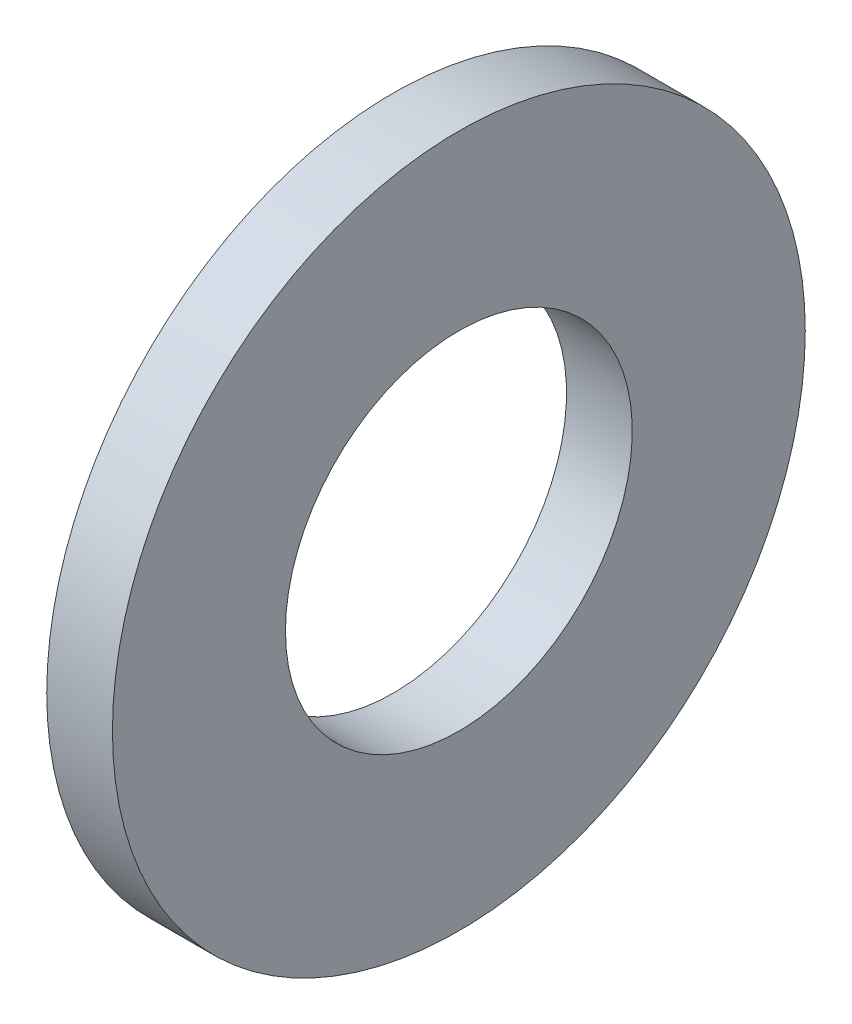
ISO-10303-21;
HEADER;
FILE_DESCRIPTION(('STEP AP214'),'2;1');
FILE_NAME('part.step','',(''),(''),'','','');
FILE_SCHEMA(('AUTOMOTIVE_DESIGN { 1 0 10303 214 1 1 1 1 }'));
ENDSEC;
DATA;
#1=APPLICATION_CONTEXT('core data for automotive mechanical design processes');
#2=APPLICATION_PROTOCOL_DEFINITION('international standard','automotive_design',2000,#1);
#3=PRODUCT_CONTEXT('',#1,'mechanical');
#4=PRODUCT('Part','Part','',(#3));
#5=PRODUCT_RELATED_PRODUCT_CATEGORY('part','',(#4));
#6=PRODUCT_DEFINITION_FORMATION('','',#4);
#7=PRODUCT_DEFINITION_CONTEXT('part definition',#1,'design');
#8=PRODUCT_DEFINITION('design','',#6,#7);
#9=PRODUCT_DEFINITION_SHAPE('','',#8);
#10=(LENGTH_UNIT() NAMED_UNIT(*) SI_UNIT(.MILLI.,.METRE.));
#11=(NAMED_UNIT(*) PLANE_ANGLE_UNIT() SI_UNIT($,.RADIAN.));
#12=(NAMED_UNIT(*) SI_UNIT($,.STERADIAN.) SOLID_ANGLE_UNIT());
#13=UNCERTAINTY_MEASURE_WITH_UNIT(LENGTH_MEASURE(1.E-05),#10,'distance_accuracy_value','');
#14=(GEOMETRIC_REPRESENTATION_CONTEXT(3) GLOBAL_UNCERTAINTY_ASSIGNED_CONTEXT((#13)) GLOBAL_UNIT_ASSIGNED_CONTEXT((#10,
#11,#12)) REPRESENTATION_CONTEXT('',''));
#15=CARTESIAN_POINT('',(0.,0.,0.));
#16=DIRECTION('',(0.,0.,1.));
#17=DIRECTION('',(1.,0.,0.));
#18=AXIS2_PLACEMENT_3D('',#15,#16,#17);
#19=CARTESIAN_POINT('',(-34.9249999999999,0.,0.));
#20=DIRECTION('',(-1.,0.,0.));
#21=DIRECTION('',(0.,0.,1.));
#22=AXIS2_PLACEMENT_3D('',#19,#20,#21);
#23=CYLINDRICAL_SURFACE('',#22,5.5626);
#24=CARTESIAN_POINT('',(0.,0.,0.));
#25=DIRECTION('',(-1.,0.,0.));
#26=DIRECTION('',(0.,0.,1.));
#27=AXIS2_PLACEMENT_3D('',#24,#25,#26);
#28=CIRCLE('',#27,5.5626);
#29=CARTESIAN_POINT('',(0.,0.,5.5626));
#30=VERTEX_POINT('',#29);
#31=EDGE_CURVE('E10',#30,#30,#28,.T.);
#32=ORIENTED_EDGE('',*,*,#31,.F.);
#33=EDGE_LOOP('',(#32));
#34=FACE_BOUND('',#33,.T.);
#35=CARTESIAN_POINT('',(-2.1082,0.,0.));
#36=DIRECTION('',(-1.,0.,0.));
#37=DIRECTION('',(0.,0.,1.));
#38=AXIS2_PLACEMENT_3D('',#35,#36,#37);
#39=CIRCLE('',#38,5.5626);
#40=CARTESIAN_POINT('',(-2.1082,0.,5.5626));
#41=VERTEX_POINT('',#40);
#42=EDGE_CURVE('E45',#41,#41,#39,.T.);
#43=ORIENTED_EDGE('',*,*,#42,.T.);
#44=EDGE_LOOP('',(#43));
#45=FACE_BOUND('',#44,.T.);
#46=ADVANCED_FACE('F31',(#34,#45),#23,.F.);
#47=CARTESIAN_POINT('',(0.,5.5626,0.));
#48=DIRECTION('',(-1.,0.,0.));
#49=DIRECTION('',(0.,0.,1.));
#50=AXIS2_PLACEMENT_3D('',#47,#48,#49);
#51=PLANE('',#50);
#52=CARTESIAN_POINT('',(0.,0.,0.));
#53=DIRECTION('',(-1.,0.,0.));
#54=DIRECTION('',(0.,0.,1.));
#55=AXIS2_PLACEMENT_3D('',#52,#53,#54);
#56=CIRCLE('',#55,11.1125);
#57=CARTESIAN_POINT('',(0.,0.,11.1125));
#58=VERTEX_POINT('',#57);
#59=EDGE_CURVE('E37',#58,#58,#56,.T.);
#60=ORIENTED_EDGE('',*,*,#59,.F.);
#61=EDGE_LOOP('',(#60));
#62=FACE_BOUND('',#61,.T.);
#63=ORIENTED_EDGE('',*,*,#31,.T.);
#64=EDGE_LOOP('',(#63));
#65=FACE_BOUND('',#64,.T.);
#66=ADVANCED_FACE('F60',(#62,#65),#51,.F.);
#67=CARTESIAN_POINT('',(-34.9249999999999,0.,0.));
#68=DIRECTION('',(-1.,0.,0.));
#69=DIRECTION('',(0.,0.,1.));
#70=AXIS2_PLACEMENT_3D('',#67,#68,#69);
#71=CYLINDRICAL_SURFACE('',#70,11.1125);
#72=CARTESIAN_POINT('',(-2.1082,0.,0.));
#73=DIRECTION('',(-1.,0.,0.));
#74=DIRECTION('',(0.,0.,1.));
#75=AXIS2_PLACEMENT_3D('',#72,#73,#74);
#76=CIRCLE('',#75,11.1125);
#77=CARTESIAN_POINT('',(-2.1082,0.,11.1125));
#78=VERTEX_POINT('',#77);
#79=EDGE_CURVE('E41',#78,#78,#76,.T.);
#80=ORIENTED_EDGE('',*,*,#79,.F.);
#81=EDGE_LOOP('',(#80));
#82=FACE_BOUND('',#81,.T.);
#83=ORIENTED_EDGE('',*,*,#59,.T.);
#84=EDGE_LOOP('',(#83));
#85=FACE_BOUND('',#84,.T.);
#86=ADVANCED_FACE('F55',(#82,#85),#71,.T.);
#87=CARTESIAN_POINT('',(-2.1082,11.1125,0.));
#88=DIRECTION('',(1.,0.,0.));
#89=DIRECTION('',(0.,0.,-1.));
#90=AXIS2_PLACEMENT_3D('',#87,#88,#89);
#91=PLANE('',#90);
#92=ORIENTED_EDGE('',*,*,#42,.F.);
#93=EDGE_LOOP('',(#92));
#94=FACE_BOUND('',#93,.T.);
#95=ORIENTED_EDGE('',*,*,#79,.T.);
#96=EDGE_LOOP('',(#95));
#97=FACE_BOUND('',#96,.T.);
#98=ADVANCED_FACE('F52',(#94,#97),#91,.F.);
#99=CLOSED_SHELL('',(#46,#66,#86,#98));
#100=MANIFOLD_SOLID_BREP('B2',#99);
#101=ADVANCED_BREP_SHAPE_REPRESENTATION('',(#18,#100),#14);
#102=SHAPE_DEFINITION_REPRESENTATION(#9,#101);
ENDSEC;
END-ISO-10303-21;
